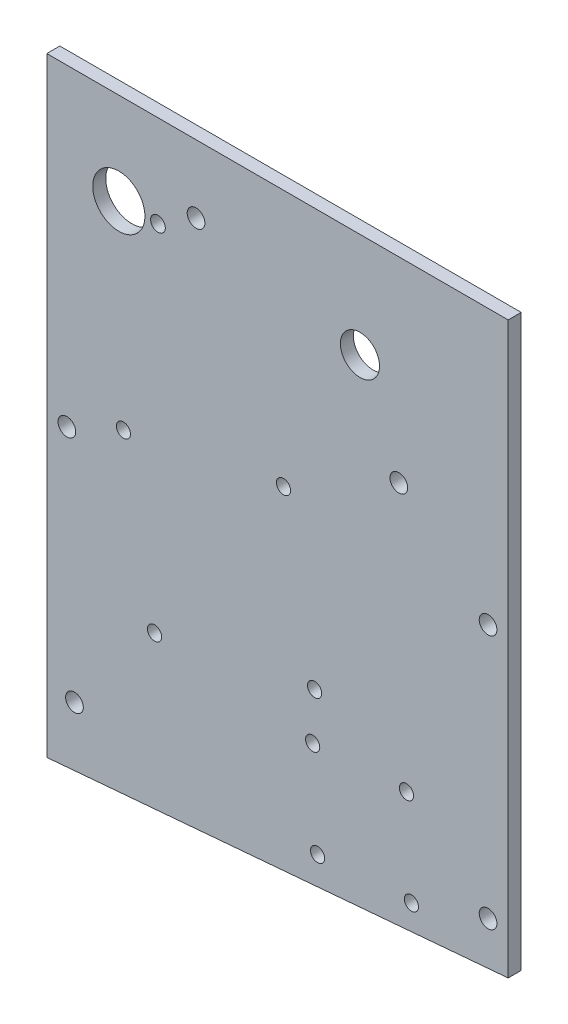
ISO-10303-21;
HEADER;
FILE_DESCRIPTION(('STEP AP214'),'2;1');
FILE_NAME('part.step','',(''),(''),'','','');
FILE_SCHEMA(('AUTOMOTIVE_DESIGN { 1 0 10303 214 1 1 1 1 }'));
ENDSEC;
DATA;
#1=APPLICATION_CONTEXT('core data for automotive mechanical design processes');
#2=APPLICATION_PROTOCOL_DEFINITION('international standard','automotive_design',2000,#1);
#3=PRODUCT_CONTEXT('',#1,'mechanical');
#4=PRODUCT('Part','Part','',(#3));
#5=PRODUCT_RELATED_PRODUCT_CATEGORY('part','',(#4));
#6=PRODUCT_DEFINITION_FORMATION('','',#4);
#7=PRODUCT_DEFINITION_CONTEXT('part definition',#1,'design');
#8=PRODUCT_DEFINITION('design','',#6,#7);
#9=PRODUCT_DEFINITION_SHAPE('','',#8);
#10=(LENGTH_UNIT() NAMED_UNIT(*) SI_UNIT(.MILLI.,.METRE.));
#11=(NAMED_UNIT(*) PLANE_ANGLE_UNIT() SI_UNIT($,.RADIAN.));
#12=(NAMED_UNIT(*) SI_UNIT($,.STERADIAN.) SOLID_ANGLE_UNIT());
#13=UNCERTAINTY_MEASURE_WITH_UNIT(LENGTH_MEASURE(1.E-05),#10,'distance_accuracy_value','');
#14=(GEOMETRIC_REPRESENTATION_CONTEXT(3) GLOBAL_UNCERTAINTY_ASSIGNED_CONTEXT((#13)) GLOBAL_UNIT_ASSIGNED_CONTEXT((#10,
#11,#12)) REPRESENTATION_CONTEXT('',''));
#15=CARTESIAN_POINT('',(0.,0.,0.));
#16=DIRECTION('',(0.,0.,1.));
#17=DIRECTION('',(1.,0.,0.));
#18=AXIS2_PLACEMENT_3D('',#15,#16,#17);
#19=CARTESIAN_POINT('',(112.268,-138.684,-3.175));
#20=DIRECTION('',(1.,0.,0.));
#21=DIRECTION('',(0.,1.,0.));
#22=AXIS2_PLACEMENT_3D('',#19,#20,#21);
#23=PLANE('',#22);
#24=DIRECTION('',(0.,1.,0.));
#25=VECTOR('',#24,1.);
#26=CARTESIAN_POINT('',(112.268,-138.684,0.));
#27=LINE('',#26,#25);
#28=CARTESIAN_POINT('',(112.268,-138.684,0.));
#29=VERTEX_POINT('',#28);
#30=CARTESIAN_POINT('',(112.268,0.,0.));
#31=VERTEX_POINT('',#30);
#32=EDGE_CURVE('E97',#29,#31,#27,.T.);
#33=ORIENTED_EDGE('',*,*,#32,.F.);
#34=DIRECTION('',(0.,0.,1.));
#35=VECTOR('',#34,1.);
#36=CARTESIAN_POINT('',(112.268,-138.684,-3.175));
#37=LINE('',#36,#35);
#38=CARTESIAN_POINT('',(112.268,-138.684,-3.175));
#39=VERTEX_POINT('',#38);
#40=EDGE_CURVE('E11',#39,#29,#37,.T.);
#41=ORIENTED_EDGE('',*,*,#40,.F.);
#42=DIRECTION('',(0.,1.,0.));
#43=VECTOR('',#42,1.);
#44=CARTESIAN_POINT('',(112.268,-138.684,-3.175));
#45=LINE('',#44,#43);
#46=CARTESIAN_POINT('',(112.268,0.,-3.175));
#47=VERTEX_POINT('',#46);
#48=EDGE_CURVE('E90',#39,#47,#45,.T.);
#49=ORIENTED_EDGE('',*,*,#48,.T.);
#50=DIRECTION('',(0.,0.,1.));
#51=VECTOR('',#50,1.);
#52=CARTESIAN_POINT('',(112.268,0.,-3.175));
#53=LINE('',#52,#51);
#54=EDGE_CURVE('E35',#47,#31,#53,.T.);
#55=ORIENTED_EDGE('',*,*,#54,.T.);
#56=EDGE_LOOP('',(#33,#41,#49,#55));
#57=FACE_BOUND('',#56,.T.);
#58=ADVANCED_FACE('F32',(#57),#23,.T.);
#59=CARTESIAN_POINT('',(0.,-148.336,-3.175));
#60=DIRECTION('',(0.0856568743177185,-0.996324696011355,0.));
#61=DIRECTION('',(0.996324696011355,0.0856568743177185,0.));
#62=AXIS2_PLACEMENT_3D('',#59,#60,#61);
#63=PLANE('',#62);
#64=DIRECTION('',(0.996324696011355,0.0856568743177185,0.));
#65=VECTOR('',#64,1.);
#66=CARTESIAN_POINT('',(0.,-148.336,0.));
#67=LINE('',#66,#65);
#68=CARTESIAN_POINT('',(0.,-148.336,0.));
#69=VERTEX_POINT('',#68);
#70=EDGE_CURVE('E92',#69,#29,#67,.T.);
#71=ORIENTED_EDGE('',*,*,#70,.F.);
#72=DIRECTION('',(0.,0.,1.));
#73=VECTOR('',#72,1.);
#74=CARTESIAN_POINT('',(0.,-148.336,-3.175));
#75=LINE('',#74,#73);
#76=CARTESIAN_POINT('',(0.,-148.336,-3.175));
#77=VERTEX_POINT('',#76);
#78=EDGE_CURVE('E41',#77,#69,#75,.T.);
#79=ORIENTED_EDGE('',*,*,#78,.F.);
#80=DIRECTION('',(0.996324696011355,0.0856568743177185,0.));
#81=VECTOR('',#80,1.);
#82=CARTESIAN_POINT('',(0.,-148.336,-3.175));
#83=LINE('',#82,#81);
#84=EDGE_CURVE('E87',#77,#39,#83,.T.);
#85=ORIENTED_EDGE('',*,*,#84,.T.);
#86=ORIENTED_EDGE('',*,*,#40,.T.);
#87=EDGE_LOOP('',(#71,#79,#85,#86));
#88=FACE_BOUND('',#87,.T.);
#89=ADVANCED_FACE('F108',(#88),#63,.T.);
#90=CARTESIAN_POINT('',(0.,0.,-3.175));
#91=DIRECTION('',(-1.,0.,0.));
#92=DIRECTION('',(0.,0.,1.));
#93=AXIS2_PLACEMENT_3D('',#90,#91,#92);
#94=PLANE('',#93);
#95=DIRECTION('',(0.,-1.,0.));
#96=VECTOR('',#95,1.);
#97=CARTESIAN_POINT('',(0.,0.,0.));
#98=LINE('',#97,#96);
#99=CARTESIAN_POINT('',(0.,0.,0.));
#100=VERTEX_POINT('',#99);
#101=EDGE_CURVE('E82',#100,#69,#98,.T.);
#102=ORIENTED_EDGE('',*,*,#101,.F.);
#103=DIRECTION('',(0.,0.,1.));
#104=VECTOR('',#103,1.);
#105=CARTESIAN_POINT('',(0.,0.,-3.175));
#106=LINE('',#105,#104);
#107=CARTESIAN_POINT('',(0.,0.,-3.175));
#108=VERTEX_POINT('',#107);
#109=EDGE_CURVE('E77',#108,#100,#106,.T.);
#110=ORIENTED_EDGE('',*,*,#109,.F.);
#111=DIRECTION('',(0.,-1.,0.));
#112=VECTOR('',#111,1.);
#113=CARTESIAN_POINT('',(0.,0.,-3.175));
#114=LINE('',#113,#112);
#115=EDGE_CURVE('E80',#108,#77,#114,.T.);
#116=ORIENTED_EDGE('',*,*,#115,.T.);
#117=ORIENTED_EDGE('',*,*,#78,.T.);
#118=EDGE_LOOP('',(#102,#110,#116,#117));
#119=FACE_BOUND('',#118,.T.);
#120=ADVANCED_FACE('F79',(#119),#94,.T.);
#121=CARTESIAN_POINT('',(112.268,0.,-3.175));
#122=DIRECTION('',(0.,1.,0.));
#123=DIRECTION('',(0.,0.,1.));
#124=AXIS2_PLACEMENT_3D('',#121,#122,#123);
#125=PLANE('',#124);
#126=DIRECTION('',(-1.,0.,0.));
#127=VECTOR('',#126,1.);
#128=CARTESIAN_POINT('',(112.268,0.,0.));
#129=LINE('',#128,#127);
#130=EDGE_CURVE('E100',#31,#100,#129,.T.);
#131=ORIENTED_EDGE('',*,*,#130,.F.);
#132=ORIENTED_EDGE('',*,*,#54,.F.);
#133=DIRECTION('',(-1.,0.,0.));
#134=VECTOR('',#133,1.);
#135=CARTESIAN_POINT('',(112.268,0.,-3.175));
#136=LINE('',#135,#134);
#137=EDGE_CURVE('E86',#47,#108,#136,.T.);
#138=ORIENTED_EDGE('',*,*,#137,.T.);
#139=ORIENTED_EDGE('',*,*,#109,.T.);
#140=EDGE_LOOP('',(#131,#132,#138,#139));
#141=FACE_BOUND('',#140,.T.);
#142=ADVANCED_FACE('F89',(#141),#125,.T.);
#143=CARTESIAN_POINT('',(0.,0.,-3.175));
#144=DIRECTION('',(0.,0.,1.));
#145=DIRECTION('',(1.,0.,0.));
#146=AXIS2_PLACEMENT_3D('',#143,#144,#145);
#147=PLANE('',#146);
#148=CARTESIAN_POINT('',(17.526,-22.352,-3.175));
#149=DIRECTION('',(0.,0.,1.));
#150=DIRECTION('',(1.,0.,0.));
#151=AXIS2_PLACEMENT_3D('',#148,#149,#150);
#152=CIRCLE('',#151,6.35);
#153=CARTESIAN_POINT('',(23.876,-22.352,-3.175));
#154=VERTEX_POINT('',#153);
#155=EDGE_CURVE('E201',#154,#154,#152,.T.);
#156=ORIENTED_EDGE('',*,*,#155,.T.);
#157=EDGE_LOOP('',(#156));
#158=FACE_BOUND('',#157,.T.);
#159=CARTESIAN_POINT('',(76.2,-25.4,-3.175));
#160=DIRECTION('',(0.,0.,1.));
#161=DIRECTION('',(1.,0.,0.));
#162=AXIS2_PLACEMENT_3D('',#159,#160,#161);
#163=CIRCLE('',#162,4.7625);
#164=CARTESIAN_POINT('',(80.9625,-25.4,-3.175));
#165=VERTEX_POINT('',#164);
#166=EDGE_CURVE('E211',#165,#165,#163,.T.);
#167=ORIENTED_EDGE('',*,*,#166,.T.);
#168=EDGE_LOOP('',(#167));
#169=FACE_BOUND('',#168,.T.);
#170=CARTESIAN_POINT('',(27.051,-22.352,-3.175));
#171=DIRECTION('',(0.,0.,1.));
#172=DIRECTION('',(1.,0.,0.));
#173=AXIS2_PLACEMENT_3D('',#170,#171,#172);
#174=CIRCLE('',#173,1.786001);
#175=CARTESIAN_POINT('',(28.837001,-22.352,-3.175));
#176=VERTEX_POINT('',#175);
#177=EDGE_CURVE('E217',#176,#176,#174,.T.);
#178=ORIENTED_EDGE('',*,*,#177,.T.);
#179=EDGE_LOOP('',(#178));
#180=FACE_BOUND('',#179,.T.);
#181=CARTESIAN_POINT('',(36.322,-16.51,-3.175));
#182=DIRECTION('',(0.,0.,1.));
#183=DIRECTION('',(1.,0.,0.));
#184=AXIS2_PLACEMENT_3D('',#181,#182,#183);
#185=CIRCLE('',#184,2.15265);
#186=CARTESIAN_POINT('',(38.47465,-16.51,-3.175));
#187=VERTEX_POINT('',#186);
#188=EDGE_CURVE('E223',#187,#187,#185,.T.);
#189=ORIENTED_EDGE('',*,*,#188,.T.);
#190=EDGE_LOOP('',(#189));
#191=FACE_BOUND('',#190,.T.);
#192=CARTESIAN_POINT('',(85.6615,-47.625,-3.175));
#193=DIRECTION('',(0.,0.,1.));
#194=DIRECTION('',(1.,0.,0.));
#195=AXIS2_PLACEMENT_3D('',#192,#193,#194);
#196=CIRCLE('',#195,2.15264999999999);
#197=CARTESIAN_POINT('',(87.81415,-47.625,-3.175));
#198=VERTEX_POINT('',#197);
#199=EDGE_CURVE('E229',#198,#198,#196,.T.);
#200=ORIENTED_EDGE('',*,*,#199,.T.);
#201=EDGE_LOOP('',(#200));
#202=FACE_BOUND('',#201,.T.);
#203=CARTESIAN_POINT('',(18.6444695764577,-70.032201580464,-3.175));
#204=DIRECTION('',(0.,0.,1.));
#205=DIRECTION('',(1.,0.,0.));
#206=AXIS2_PLACEMENT_3D('',#203,#204,#205);
#207=CIRCLE('',#206,1.72719999999999);
#208=CARTESIAN_POINT('',(20.3716695764577,-70.032201580464,-3.175));
#209=VERTEX_POINT('',#208);
#210=EDGE_CURVE('E235',#209,#209,#207,.T.);
#211=ORIENTED_EDGE('',*,*,#210,.T.);
#212=EDGE_LOOP('',(#211));
#213=FACE_BOUND('',#212,.T.);
#214=CARTESIAN_POINT('',(57.602798419536,-62.4594695764574,-3.175));
#215=DIRECTION('',(0.,0.,1.));
#216=DIRECTION('',(1.,0.,0.));
#217=AXIS2_PLACEMENT_3D('',#214,#215,#216);
#218=CIRCLE('',#217,1.7272);
#219=CARTESIAN_POINT('',(59.329998419536,-62.4594695764574,-3.175));
#220=VERTEX_POINT('',#219);
#221=EDGE_CURVE('E241',#220,#220,#218,.T.);
#222=ORIENTED_EDGE('',*,*,#221,.T.);
#223=EDGE_LOOP('',(#222));
#224=FACE_BOUND('',#223,.T.);
#225=CARTESIAN_POINT('',(65.1755304235415,-101.417798419535,-3.175));
#226=DIRECTION('',(0.,0.,1.));
#227=DIRECTION('',(1.,0.,0.));
#228=AXIS2_PLACEMENT_3D('',#225,#226,#227);
#229=CIRCLE('',#228,1.7272);
#230=CARTESIAN_POINT('',(66.9027304235415,-101.417798419535,-3.175));
#231=VERTEX_POINT('',#230);
#232=EDGE_CURVE('E247',#231,#231,#229,.T.);
#233=ORIENTED_EDGE('',*,*,#232,.T.);
#234=EDGE_LOOP('',(#233));
#235=FACE_BOUND('',#234,.T.);
#236=CARTESIAN_POINT('',(26.217201580465,-108.990530423541,-3.175));
#237=DIRECTION('',(0.,0.,1.));
#238=DIRECTION('',(1.,0.,0.));
#239=AXIS2_PLACEMENT_3D('',#236,#237,#238);
#240=CIRCLE('',#239,1.72719999999999);
#241=CARTESIAN_POINT('',(27.944401580465,-108.990530423541,-3.175));
#242=VERTEX_POINT('',#241);
#243=EDGE_CURVE('E253',#242,#242,#240,.T.);
#244=ORIENTED_EDGE('',*,*,#243,.T.);
#245=EDGE_LOOP('',(#244));
#246=FACE_BOUND('',#245,.T.);
#247=CARTESIAN_POINT('',(65.8918643976101,-135.8375355621,-3.175));
#248=DIRECTION('',(0.,0.,1.));
#249=DIRECTION('',(1.,0.,0.));
#250=AXIS2_PLACEMENT_3D('',#247,#248,#249);
#251=CIRCLE('',#250,1.7272);
#252=CARTESIAN_POINT('',(67.6190643976101,-135.8375355621,-3.175));
#253=VERTEX_POINT('',#252);
#254=EDGE_CURVE('E259',#253,#253,#251,.T.);
#255=ORIENTED_EDGE('',*,*,#254,.T.);
#256=EDGE_LOOP('',(#255));
#257=FACE_BOUND('',#256,.T.);
#258=CARTESIAN_POINT('',(88.7205355621015,-134.641135602388,-3.175));
#259=DIRECTION('',(0.,0.,1.));
#260=DIRECTION('',(1.,0.,0.));
#261=AXIS2_PLACEMENT_3D('',#258,#259,#260);
#262=CIRCLE('',#261,1.7272);
#263=CARTESIAN_POINT('',(90.4477355621015,-134.641135602388,-3.175));
#264=VERTEX_POINT('',#263);
#265=EDGE_CURVE('E265',#264,#264,#262,.T.);
#266=ORIENTED_EDGE('',*,*,#265,.T.);
#267=EDGE_LOOP('',(#266));
#268=FACE_BOUND('',#267,.T.);
#269=CARTESIAN_POINT('',(87.5241356023876,-111.812464437898,-3.175));
#270=DIRECTION('',(0.,0.,1.));
#271=DIRECTION('',(1.,0.,0.));
#272=AXIS2_PLACEMENT_3D('',#269,#270,#271);
#273=CIRCLE('',#272,1.7272);
#274=CARTESIAN_POINT('',(89.2513356023876,-111.812464437898,-3.175));
#275=VERTEX_POINT('',#274);
#276=EDGE_CURVE('E271',#275,#275,#273,.T.);
#277=ORIENTED_EDGE('',*,*,#276,.T.);
#278=EDGE_LOOP('',(#277));
#279=FACE_BOUND('',#278,.T.);
#280=CARTESIAN_POINT('',(64.6954644378985,-113.008864397612,-3.175));
#281=DIRECTION('',(0.,0.,1.));
#282=DIRECTION('',(1.,0.,0.));
#283=AXIS2_PLACEMENT_3D('',#280,#281,#282);
#284=CIRCLE('',#283,1.7272);
#285=CARTESIAN_POINT('',(66.4226644378984,-113.008864397612,-3.175));
#286=VERTEX_POINT('',#285);
#287=EDGE_CURVE('E277',#286,#286,#284,.T.);
#288=ORIENTED_EDGE('',*,*,#287,.T.);
#289=EDGE_LOOP('',(#288));
#290=FACE_BOUND('',#289,.T.);
#291=CARTESIAN_POINT('',(6.731,-133.35,-3.175));
#292=DIRECTION('',(0.,0.,1.));
#293=DIRECTION('',(1.,0.,0.));
#294=AXIS2_PLACEMENT_3D('',#291,#292,#293);
#295=CIRCLE('',#294,2.15265);
#296=CARTESIAN_POINT('',(8.88365,-133.35,-3.175));
#297=VERTEX_POINT('',#296);
#298=EDGE_CURVE('E283',#297,#297,#295,.T.);
#299=ORIENTED_EDGE('',*,*,#298,.T.);
#300=EDGE_LOOP('',(#299));
#301=FACE_BOUND('',#300,.T.);
#302=CARTESIAN_POINT('',(107.3785,-128.5875,-3.175));
#303=DIRECTION('',(0.,0.,1.));
#304=DIRECTION('',(1.,0.,0.));
#305=AXIS2_PLACEMENT_3D('',#302,#303,#304);
#306=CIRCLE('',#305,2.15264999999999);
#307=CARTESIAN_POINT('',(109.53115,-128.5875,-3.175));
#308=VERTEX_POINT('',#307);
#309=EDGE_CURVE('E289',#308,#308,#306,.T.);
#310=ORIENTED_EDGE('',*,*,#309,.T.);
#311=EDGE_LOOP('',(#310));
#312=FACE_BOUND('',#311,.T.);
#313=CARTESIAN_POINT('',(107.3785,-66.675,-3.175));
#314=DIRECTION('',(0.,0.,1.));
#315=DIRECTION('',(1.,0.,0.));
#316=AXIS2_PLACEMENT_3D('',#313,#314,#315);
#317=CIRCLE('',#316,2.15264999999999);
#318=CARTESIAN_POINT('',(109.53115,-66.675,-3.175));
#319=VERTEX_POINT('',#318);
#320=EDGE_CURVE('E295',#319,#319,#317,.T.);
#321=ORIENTED_EDGE('',*,*,#320,.T.);
#322=EDGE_LOOP('',(#321));
#323=FACE_BOUND('',#322,.T.);
#324=CARTESIAN_POINT('',(4.8895,-76.2,-3.175));
#325=DIRECTION('',(0.,0.,1.));
#326=DIRECTION('',(1.,0.,0.));
#327=AXIS2_PLACEMENT_3D('',#324,#325,#326);
#328=CIRCLE('',#327,2.15265);
#329=CARTESIAN_POINT('',(7.04215,-76.2,-3.175));
#330=VERTEX_POINT('',#329);
#331=EDGE_CURVE('E101',#330,#330,#328,.T.);
#332=ORIENTED_EDGE('',*,*,#331,.T.);
#333=EDGE_LOOP('',(#332));
#334=FACE_BOUND('',#333,.T.);
#335=ORIENTED_EDGE('',*,*,#48,.F.);
#336=ORIENTED_EDGE('',*,*,#84,.F.);
#337=ORIENTED_EDGE('',*,*,#115,.F.);
#338=ORIENTED_EDGE('',*,*,#137,.F.);
#339=EDGE_LOOP('',(#335,#336,#337,#338));
#340=FACE_BOUND('',#339,.T.);
#341=ADVANCED_FACE('F85',(#158,#169,#180,#191,#202,#213,#224,#235,#246,#257,#268,#279,#290,#301,
#312,#323,#334,#340),#147,.F.);
#342=CARTESIAN_POINT('',(0.,0.,0.));
#343=DIRECTION('',(0.,0.,1.));
#344=DIRECTION('',(1.,0.,0.));
#345=AXIS2_PLACEMENT_3D('',#342,#343,#344);
#346=PLANE('',#345);
#347=CARTESIAN_POINT('',(17.526,-22.352,0.));
#348=DIRECTION('',(0.,0.,1.));
#349=DIRECTION('',(1.,0.,0.));
#350=AXIS2_PLACEMENT_3D('',#347,#348,#349);
#351=CIRCLE('',#350,6.35);
#352=CARTESIAN_POINT('',(23.876,-22.352,0.));
#353=VERTEX_POINT('',#352);
#354=EDGE_CURVE('E204',#353,#353,#351,.T.);
#355=ORIENTED_EDGE('',*,*,#354,.F.);
#356=EDGE_LOOP('',(#355));
#357=FACE_BOUND('',#356,.T.);
#358=CARTESIAN_POINT('',(76.2,-25.4,0.));
#359=DIRECTION('',(0.,0.,1.));
#360=DIRECTION('',(1.,0.,0.));
#361=AXIS2_PLACEMENT_3D('',#358,#359,#360);
#362=CIRCLE('',#361,4.7625);
#363=CARTESIAN_POINT('',(80.9625,-25.4,0.));
#364=VERTEX_POINT('',#363);
#365=EDGE_CURVE('E206',#364,#364,#362,.T.);
#366=ORIENTED_EDGE('',*,*,#365,.F.);
#367=EDGE_LOOP('',(#366));
#368=FACE_BOUND('',#367,.T.);
#369=CARTESIAN_POINT('',(27.051,-22.352,0.));
#370=DIRECTION('',(0.,0.,1.));
#371=DIRECTION('',(1.,0.,0.));
#372=AXIS2_PLACEMENT_3D('',#369,#370,#371);
#373=CIRCLE('',#372,1.786001);
#374=CARTESIAN_POINT('',(28.837001,-22.352,0.));
#375=VERTEX_POINT('',#374);
#376=EDGE_CURVE('E214',#375,#375,#373,.T.);
#377=ORIENTED_EDGE('',*,*,#376,.F.);
#378=EDGE_LOOP('',(#377));
#379=FACE_BOUND('',#378,.T.);
#380=CARTESIAN_POINT('',(36.322,-16.51,0.));
#381=DIRECTION('',(0.,0.,1.));
#382=DIRECTION('',(1.,0.,0.));
#383=AXIS2_PLACEMENT_3D('',#380,#381,#382);
#384=CIRCLE('',#383,2.15265);
#385=CARTESIAN_POINT('',(38.47465,-16.51,0.));
#386=VERTEX_POINT('',#385);
#387=EDGE_CURVE('E220',#386,#386,#384,.T.);
#388=ORIENTED_EDGE('',*,*,#387,.F.);
#389=EDGE_LOOP('',(#388));
#390=FACE_BOUND('',#389,.T.);
#391=CARTESIAN_POINT('',(85.6615,-47.625,0.));
#392=DIRECTION('',(0.,0.,1.));
#393=DIRECTION('',(1.,0.,0.));
#394=AXIS2_PLACEMENT_3D('',#391,#392,#393);
#395=CIRCLE('',#394,2.15264999999999);
#396=CARTESIAN_POINT('',(87.81415,-47.625,0.));
#397=VERTEX_POINT('',#396);
#398=EDGE_CURVE('E226',#397,#397,#395,.T.);
#399=ORIENTED_EDGE('',*,*,#398,.F.);
#400=EDGE_LOOP('',(#399));
#401=FACE_BOUND('',#400,.T.);
#402=CARTESIAN_POINT('',(18.6444695764577,-70.032201580464,0.));
#403=DIRECTION('',(0.,0.,1.));
#404=DIRECTION('',(1.,0.,0.));
#405=AXIS2_PLACEMENT_3D('',#402,#403,#404);
#406=CIRCLE('',#405,1.7272);
#407=CARTESIAN_POINT('',(20.3716695764577,-70.032201580464,0.));
#408=VERTEX_POINT('',#407);
#409=EDGE_CURVE('E232',#408,#408,#406,.T.);
#410=ORIENTED_EDGE('',*,*,#409,.F.);
#411=EDGE_LOOP('',(#410));
#412=FACE_BOUND('',#411,.T.);
#413=CARTESIAN_POINT('',(57.602798419536,-62.4594695764574,0.));
#414=DIRECTION('',(0.,0.,1.));
#415=DIRECTION('',(1.,0.,0.));
#416=AXIS2_PLACEMENT_3D('',#413,#414,#415);
#417=CIRCLE('',#416,1.7272);
#418=CARTESIAN_POINT('',(59.329998419536,-62.4594695764574,0.));
#419=VERTEX_POINT('',#418);
#420=EDGE_CURVE('E238',#419,#419,#417,.T.);
#421=ORIENTED_EDGE('',*,*,#420,.F.);
#422=EDGE_LOOP('',(#421));
#423=FACE_BOUND('',#422,.T.);
#424=CARTESIAN_POINT('',(65.1755304235415,-101.417798419535,0.));
#425=DIRECTION('',(0.,0.,1.));
#426=DIRECTION('',(1.,0.,0.));
#427=AXIS2_PLACEMENT_3D('',#424,#425,#426);
#428=CIRCLE('',#427,1.7272);
#429=CARTESIAN_POINT('',(66.9027304235415,-101.417798419535,0.));
#430=VERTEX_POINT('',#429);
#431=EDGE_CURVE('E244',#430,#430,#428,.T.);
#432=ORIENTED_EDGE('',*,*,#431,.F.);
#433=EDGE_LOOP('',(#432));
#434=FACE_BOUND('',#433,.T.);
#435=CARTESIAN_POINT('',(26.217201580465,-108.990530423541,0.));
#436=DIRECTION('',(0.,0.,1.));
#437=DIRECTION('',(1.,0.,0.));
#438=AXIS2_PLACEMENT_3D('',#435,#436,#437);
#439=CIRCLE('',#438,1.7272);
#440=CARTESIAN_POINT('',(27.944401580465,-108.990530423541,0.));
#441=VERTEX_POINT('',#440);
#442=EDGE_CURVE('E250',#441,#441,#439,.T.);
#443=ORIENTED_EDGE('',*,*,#442,.F.);
#444=EDGE_LOOP('',(#443));
#445=FACE_BOUND('',#444,.T.);
#446=CARTESIAN_POINT('',(65.8918643976101,-135.8375355621,0.));
#447=DIRECTION('',(0.,0.,1.));
#448=DIRECTION('',(1.,0.,0.));
#449=AXIS2_PLACEMENT_3D('',#446,#447,#448);
#450=CIRCLE('',#449,1.7272);
#451=CARTESIAN_POINT('',(67.6190643976101,-135.8375355621,0.));
#452=VERTEX_POINT('',#451);
#453=EDGE_CURVE('E256',#452,#452,#450,.T.);
#454=ORIENTED_EDGE('',*,*,#453,.F.);
#455=EDGE_LOOP('',(#454));
#456=FACE_BOUND('',#455,.T.);
#457=CARTESIAN_POINT('',(88.7205355621015,-134.641135602388,0.));
#458=DIRECTION('',(0.,0.,1.));
#459=DIRECTION('',(1.,0.,0.));
#460=AXIS2_PLACEMENT_3D('',#457,#458,#459);
#461=CIRCLE('',#460,1.7272);
#462=CARTESIAN_POINT('',(90.4477355621015,-134.641135602388,0.));
#463=VERTEX_POINT('',#462);
#464=EDGE_CURVE('E262',#463,#463,#461,.T.);
#465=ORIENTED_EDGE('',*,*,#464,.F.);
#466=EDGE_LOOP('',(#465));
#467=FACE_BOUND('',#466,.T.);
#468=CARTESIAN_POINT('',(87.5241356023876,-111.812464437898,0.));
#469=DIRECTION('',(0.,0.,1.));
#470=DIRECTION('',(1.,0.,0.));
#471=AXIS2_PLACEMENT_3D('',#468,#469,#470);
#472=CIRCLE('',#471,1.7272);
#473=CARTESIAN_POINT('',(89.2513356023876,-111.812464437898,0.));
#474=VERTEX_POINT('',#473);
#475=EDGE_CURVE('E268',#474,#474,#472,.T.);
#476=ORIENTED_EDGE('',*,*,#475,.F.);
#477=EDGE_LOOP('',(#476));
#478=FACE_BOUND('',#477,.T.);
#479=CARTESIAN_POINT('',(64.6954644378985,-113.008864397612,0.));
#480=DIRECTION('',(0.,0.,1.));
#481=DIRECTION('',(1.,0.,0.));
#482=AXIS2_PLACEMENT_3D('',#479,#480,#481);
#483=CIRCLE('',#482,1.7272);
#484=CARTESIAN_POINT('',(66.4226644378984,-113.008864397612,0.));
#485=VERTEX_POINT('',#484);
#486=EDGE_CURVE('E274',#485,#485,#483,.T.);
#487=ORIENTED_EDGE('',*,*,#486,.F.);
#488=EDGE_LOOP('',(#487));
#489=FACE_BOUND('',#488,.T.);
#490=CARTESIAN_POINT('',(6.731,-133.35,0.));
#491=DIRECTION('',(0.,0.,1.));
#492=DIRECTION('',(1.,0.,0.));
#493=AXIS2_PLACEMENT_3D('',#490,#491,#492);
#494=CIRCLE('',#493,2.15264999999999);
#495=CARTESIAN_POINT('',(8.88364999999999,-133.35,0.));
#496=VERTEX_POINT('',#495);
#497=EDGE_CURVE('E280',#496,#496,#494,.T.);
#498=ORIENTED_EDGE('',*,*,#497,.F.);
#499=EDGE_LOOP('',(#498));
#500=FACE_BOUND('',#499,.T.);
#501=CARTESIAN_POINT('',(107.3785,-128.5875,0.));
#502=DIRECTION('',(0.,0.,1.));
#503=DIRECTION('',(1.,0.,0.));
#504=AXIS2_PLACEMENT_3D('',#501,#502,#503);
#505=CIRCLE('',#504,2.15264999999999);
#506=CARTESIAN_POINT('',(109.53115,-128.5875,0.));
#507=VERTEX_POINT('',#506);
#508=EDGE_CURVE('E286',#507,#507,#505,.T.);
#509=ORIENTED_EDGE('',*,*,#508,.F.);
#510=EDGE_LOOP('',(#509));
#511=FACE_BOUND('',#510,.T.);
#512=CARTESIAN_POINT('',(107.3785,-66.675,0.));
#513=DIRECTION('',(0.,0.,1.));
#514=DIRECTION('',(1.,0.,0.));
#515=AXIS2_PLACEMENT_3D('',#512,#513,#514);
#516=CIRCLE('',#515,2.15264999999999);
#517=CARTESIAN_POINT('',(109.53115,-66.675,0.));
#518=VERTEX_POINT('',#517);
#519=EDGE_CURVE('E292',#518,#518,#516,.T.);
#520=ORIENTED_EDGE('',*,*,#519,.F.);
#521=EDGE_LOOP('',(#520));
#522=FACE_BOUND('',#521,.T.);
#523=CARTESIAN_POINT('',(4.8895,-76.2,0.));
#524=DIRECTION('',(0.,0.,1.));
#525=DIRECTION('',(1.,0.,0.));
#526=AXIS2_PLACEMENT_3D('',#523,#524,#525);
#527=CIRCLE('',#526,2.15264999999999);
#528=CARTESIAN_POINT('',(7.04214999999999,-76.2,0.));
#529=VERTEX_POINT('',#528);
#530=EDGE_CURVE('E298',#529,#529,#527,.T.);
#531=ORIENTED_EDGE('',*,*,#530,.F.);
#532=EDGE_LOOP('',(#531));
#533=FACE_BOUND('',#532,.T.);
#534=ORIENTED_EDGE('',*,*,#32,.T.);
#535=ORIENTED_EDGE('',*,*,#130,.T.);
#536=ORIENTED_EDGE('',*,*,#101,.T.);
#537=ORIENTED_EDGE('',*,*,#70,.T.);
#538=EDGE_LOOP('',(#534,#535,#536,#537));
#539=FACE_BOUND('',#538,.T.);
#540=ADVANCED_FACE('F107',(#357,#368,#379,#390,#401,#412,#423,#434,#445,#456,#467,#478,#489,
#500,#511,#522,#533,#539),#346,.T.);
#541=CARTESIAN_POINT('',(4.8895,-76.2,0.));
#542=DIRECTION('',(0.,0.,1.));
#543=DIRECTION('',(1.,0.,0.));
#544=AXIS2_PLACEMENT_3D('',#541,#542,#543);
#545=CYLINDRICAL_SURFACE('',#544,2.15264999999999);
#546=ORIENTED_EDGE('',*,*,#331,.F.);
#547=EDGE_LOOP('',(#546));
#548=FACE_BOUND('',#547,.T.);
#549=ORIENTED_EDGE('',*,*,#530,.T.);
#550=EDGE_LOOP('',(#549));
#551=FACE_BOUND('',#550,.T.);
#552=ADVANCED_FACE('F126',(#548,#551),#545,.F.);
#553=CARTESIAN_POINT('',(107.3785,-66.675,0.));
#554=DIRECTION('',(0.,0.,1.));
#555=DIRECTION('',(1.,0.,0.));
#556=AXIS2_PLACEMENT_3D('',#553,#554,#555);
#557=CYLINDRICAL_SURFACE('',#556,2.15264999999999);
#558=ORIENTED_EDGE('',*,*,#320,.F.);
#559=EDGE_LOOP('',(#558));
#560=FACE_BOUND('',#559,.T.);
#561=ORIENTED_EDGE('',*,*,#519,.T.);
#562=EDGE_LOOP('',(#561));
#563=FACE_BOUND('',#562,.T.);
#564=ADVANCED_FACE('F133',(#560,#563),#557,.F.);
#565=CARTESIAN_POINT('',(107.3785,-128.5875,0.));
#566=DIRECTION('',(0.,0.,1.));
#567=DIRECTION('',(1.,0.,0.));
#568=AXIS2_PLACEMENT_3D('',#565,#566,#567);
#569=CYLINDRICAL_SURFACE('',#568,2.15264999999999);
#570=ORIENTED_EDGE('',*,*,#309,.F.);
#571=EDGE_LOOP('',(#570));
#572=FACE_BOUND('',#571,.T.);
#573=ORIENTED_EDGE('',*,*,#508,.T.);
#574=EDGE_LOOP('',(#573));
#575=FACE_BOUND('',#574,.T.);
#576=ADVANCED_FACE('F137',(#572,#575),#569,.F.);
#577=CARTESIAN_POINT('',(6.731,-133.35,0.));
#578=DIRECTION('',(0.,0.,1.));
#579=DIRECTION('',(1.,0.,0.));
#580=AXIS2_PLACEMENT_3D('',#577,#578,#579);
#581=CYLINDRICAL_SURFACE('',#580,2.15264999999999);
#582=ORIENTED_EDGE('',*,*,#298,.F.);
#583=EDGE_LOOP('',(#582));
#584=FACE_BOUND('',#583,.T.);
#585=ORIENTED_EDGE('',*,*,#497,.T.);
#586=EDGE_LOOP('',(#585));
#587=FACE_BOUND('',#586,.T.);
#588=ADVANCED_FACE('F141',(#584,#587),#581,.F.);
#589=CARTESIAN_POINT('',(64.6954644378985,-113.008864397612,0.));
#590=DIRECTION('',(0.,0.,1.));
#591=DIRECTION('',(1.,0.,0.));
#592=AXIS2_PLACEMENT_3D('',#589,#590,#591);
#593=CYLINDRICAL_SURFACE('',#592,1.7272);
#594=ORIENTED_EDGE('',*,*,#287,.F.);
#595=EDGE_LOOP('',(#594));
#596=FACE_BOUND('',#595,.T.);
#597=ORIENTED_EDGE('',*,*,#486,.T.);
#598=EDGE_LOOP('',(#597));
#599=FACE_BOUND('',#598,.T.);
#600=ADVANCED_FACE('F145',(#596,#599),#593,.F.);
#601=CARTESIAN_POINT('',(87.5241356023876,-111.812464437898,0.));
#602=DIRECTION('',(0.,0.,1.));
#603=DIRECTION('',(1.,0.,0.));
#604=AXIS2_PLACEMENT_3D('',#601,#602,#603);
#605=CYLINDRICAL_SURFACE('',#604,1.7272);
#606=ORIENTED_EDGE('',*,*,#276,.F.);
#607=EDGE_LOOP('',(#606));
#608=FACE_BOUND('',#607,.T.);
#609=ORIENTED_EDGE('',*,*,#475,.T.);
#610=EDGE_LOOP('',(#609));
#611=FACE_BOUND('',#610,.T.);
#612=ADVANCED_FACE('F149',(#608,#611),#605,.F.);
#613=CARTESIAN_POINT('',(88.7205355621015,-134.641135602388,0.));
#614=DIRECTION('',(0.,0.,1.));
#615=DIRECTION('',(1.,0.,0.));
#616=AXIS2_PLACEMENT_3D('',#613,#614,#615);
#617=CYLINDRICAL_SURFACE('',#616,1.7272);
#618=ORIENTED_EDGE('',*,*,#265,.F.);
#619=EDGE_LOOP('',(#618));
#620=FACE_BOUND('',#619,.T.);
#621=ORIENTED_EDGE('',*,*,#464,.T.);
#622=EDGE_LOOP('',(#621));
#623=FACE_BOUND('',#622,.T.);
#624=ADVANCED_FACE('F153',(#620,#623),#617,.F.);
#625=CARTESIAN_POINT('',(65.8918643976101,-135.8375355621,0.));
#626=DIRECTION('',(0.,0.,1.));
#627=DIRECTION('',(1.,0.,0.));
#628=AXIS2_PLACEMENT_3D('',#625,#626,#627);
#629=CYLINDRICAL_SURFACE('',#628,1.7272);
#630=ORIENTED_EDGE('',*,*,#254,.F.);
#631=EDGE_LOOP('',(#630));
#632=FACE_BOUND('',#631,.T.);
#633=ORIENTED_EDGE('',*,*,#453,.T.);
#634=EDGE_LOOP('',(#633));
#635=FACE_BOUND('',#634,.T.);
#636=ADVANCED_FACE('F157',(#632,#635),#629,.F.);
#637=CARTESIAN_POINT('',(26.217201580465,-108.990530423541,0.));
#638=DIRECTION('',(0.,0.,1.));
#639=DIRECTION('',(1.,0.,0.));
#640=AXIS2_PLACEMENT_3D('',#637,#638,#639);
#641=CYLINDRICAL_SURFACE('',#640,1.7272);
#642=ORIENTED_EDGE('',*,*,#243,.F.);
#643=EDGE_LOOP('',(#642));
#644=FACE_BOUND('',#643,.T.);
#645=ORIENTED_EDGE('',*,*,#442,.T.);
#646=EDGE_LOOP('',(#645));
#647=FACE_BOUND('',#646,.T.);
#648=ADVANCED_FACE('F161',(#644,#647),#641,.F.);
#649=CARTESIAN_POINT('',(65.1755304235415,-101.417798419535,0.));
#650=DIRECTION('',(0.,0.,1.));
#651=DIRECTION('',(1.,0.,0.));
#652=AXIS2_PLACEMENT_3D('',#649,#650,#651);
#653=CYLINDRICAL_SURFACE('',#652,1.7272);
#654=ORIENTED_EDGE('',*,*,#232,.F.);
#655=EDGE_LOOP('',(#654));
#656=FACE_BOUND('',#655,.T.);
#657=ORIENTED_EDGE('',*,*,#431,.T.);
#658=EDGE_LOOP('',(#657));
#659=FACE_BOUND('',#658,.T.);
#660=ADVANCED_FACE('F165',(#656,#659),#653,.F.);
#661=CARTESIAN_POINT('',(57.602798419536,-62.4594695764574,0.));
#662=DIRECTION('',(0.,0.,1.));
#663=DIRECTION('',(1.,0.,0.));
#664=AXIS2_PLACEMENT_3D('',#661,#662,#663);
#665=CYLINDRICAL_SURFACE('',#664,1.7272);
#666=ORIENTED_EDGE('',*,*,#221,.F.);
#667=EDGE_LOOP('',(#666));
#668=FACE_BOUND('',#667,.T.);
#669=ORIENTED_EDGE('',*,*,#420,.T.);
#670=EDGE_LOOP('',(#669));
#671=FACE_BOUND('',#670,.T.);
#672=ADVANCED_FACE('F169',(#668,#671),#665,.F.);
#673=CARTESIAN_POINT('',(18.6444695764577,-70.032201580464,0.));
#674=DIRECTION('',(0.,0.,1.));
#675=DIRECTION('',(1.,0.,0.));
#676=AXIS2_PLACEMENT_3D('',#673,#674,#675);
#677=CYLINDRICAL_SURFACE('',#676,1.7272);
#678=ORIENTED_EDGE('',*,*,#210,.F.);
#679=EDGE_LOOP('',(#678));
#680=FACE_BOUND('',#679,.T.);
#681=ORIENTED_EDGE('',*,*,#409,.T.);
#682=EDGE_LOOP('',(#681));
#683=FACE_BOUND('',#682,.T.);
#684=ADVANCED_FACE('F173',(#680,#683),#677,.F.);
#685=CARTESIAN_POINT('',(85.6615,-47.625,0.));
#686=DIRECTION('',(0.,0.,1.));
#687=DIRECTION('',(1.,0.,0.));
#688=AXIS2_PLACEMENT_3D('',#685,#686,#687);
#689=CYLINDRICAL_SURFACE('',#688,2.15264999999999);
#690=ORIENTED_EDGE('',*,*,#199,.F.);
#691=EDGE_LOOP('',(#690));
#692=FACE_BOUND('',#691,.T.);
#693=ORIENTED_EDGE('',*,*,#398,.T.);
#694=EDGE_LOOP('',(#693));
#695=FACE_BOUND('',#694,.T.);
#696=ADVANCED_FACE('F177',(#692,#695),#689,.F.);
#697=CARTESIAN_POINT('',(36.322,-16.51,0.));
#698=DIRECTION('',(0.,0.,1.));
#699=DIRECTION('',(1.,0.,0.));
#700=AXIS2_PLACEMENT_3D('',#697,#698,#699);
#701=CYLINDRICAL_SURFACE('',#700,2.15265);
#702=ORIENTED_EDGE('',*,*,#188,.F.);
#703=EDGE_LOOP('',(#702));
#704=FACE_BOUND('',#703,.T.);
#705=ORIENTED_EDGE('',*,*,#387,.T.);
#706=EDGE_LOOP('',(#705));
#707=FACE_BOUND('',#706,.T.);
#708=ADVANCED_FACE('F181',(#704,#707),#701,.F.);
#709=CARTESIAN_POINT('',(27.051,-22.352,0.));
#710=DIRECTION('',(0.,0.,1.));
#711=DIRECTION('',(1.,0.,0.));
#712=AXIS2_PLACEMENT_3D('',#709,#710,#711);
#713=CYLINDRICAL_SURFACE('',#712,1.786001);
#714=ORIENTED_EDGE('',*,*,#177,.F.);
#715=EDGE_LOOP('',(#714));
#716=FACE_BOUND('',#715,.T.);
#717=ORIENTED_EDGE('',*,*,#376,.T.);
#718=EDGE_LOOP('',(#717));
#719=FACE_BOUND('',#718,.T.);
#720=ADVANCED_FACE('F185',(#716,#719),#713,.F.);
#721=CARTESIAN_POINT('',(76.2,-25.4,0.));
#722=DIRECTION('',(0.,0.,1.));
#723=DIRECTION('',(1.,0.,0.));
#724=AXIS2_PLACEMENT_3D('',#721,#722,#723);
#725=CYLINDRICAL_SURFACE('',#724,4.7625);
#726=ORIENTED_EDGE('',*,*,#166,.F.);
#727=EDGE_LOOP('',(#726));
#728=FACE_BOUND('',#727,.T.);
#729=ORIENTED_EDGE('',*,*,#365,.T.);
#730=EDGE_LOOP('',(#729));
#731=FACE_BOUND('',#730,.T.);
#732=ADVANCED_FACE('F189',(#728,#731),#725,.F.);
#733=CARTESIAN_POINT('',(17.526,-22.352,0.));
#734=DIRECTION('',(0.,0.,1.));
#735=DIRECTION('',(1.,0.,0.));
#736=AXIS2_PLACEMENT_3D('',#733,#734,#735);
#737=CYLINDRICAL_SURFACE('',#736,6.35);
#738=ORIENTED_EDGE('',*,*,#155,.F.);
#739=EDGE_LOOP('',(#738));
#740=FACE_BOUND('',#739,.T.);
#741=ORIENTED_EDGE('',*,*,#354,.T.);
#742=EDGE_LOOP('',(#741));
#743=FACE_BOUND('',#742,.T.);
#744=ADVANCED_FACE('F193',(#740,#743),#737,.F.);
#745=CLOSED_SHELL('',(#58,#89,#120,#142,#341,#540,#552,#564,#576,#588,#600,#612,#624,#636,#648,
#660,#672,#684,#696,#708,#720,#732,#744));
#746=MANIFOLD_SOLID_BREP('B2',#745);
#747=ADVANCED_BREP_SHAPE_REPRESENTATION('',(#18,#746),#14);
#748=SHAPE_DEFINITION_REPRESENTATION(#9,#747);
ENDSEC;
END-ISO-10303-21;
